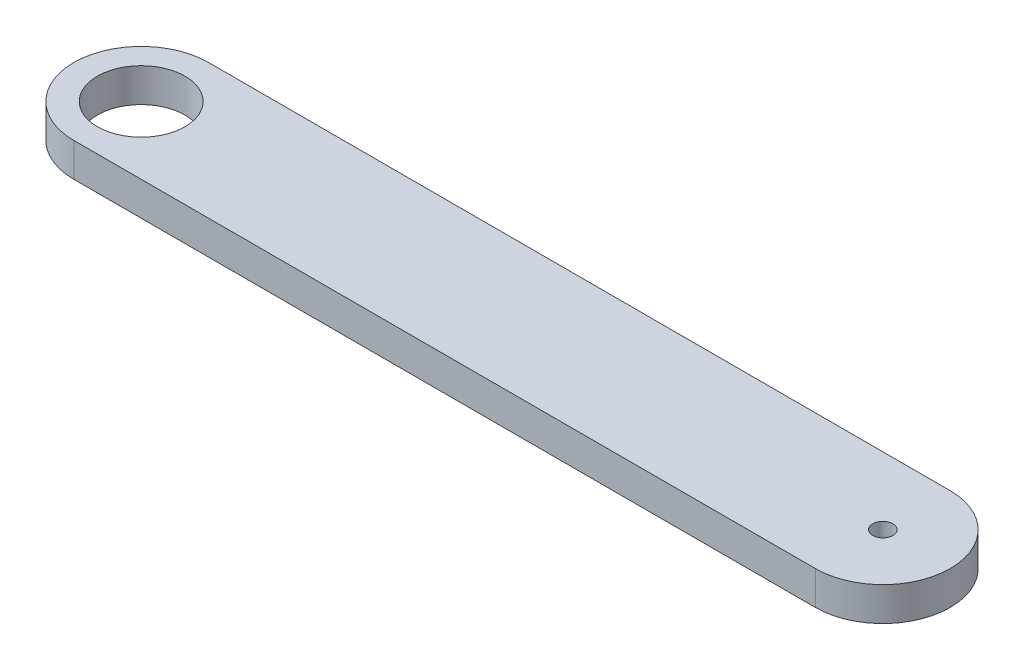
ISO-10303-21;
HEADER;
FILE_DESCRIPTION(('STEP AP214'),'2;1');
FILE_NAME('part.step','',(''),(''),'','','');
FILE_SCHEMA(('AUTOMOTIVE_DESIGN { 1 0 10303 214 1 1 1 1 }'));
ENDSEC;
DATA;
#1=APPLICATION_CONTEXT('core data for automotive mechanical design processes');
#2=APPLICATION_PROTOCOL_DEFINITION('international standard','automotive_design',2000,#1);
#3=PRODUCT_CONTEXT('',#1,'mechanical');
#4=PRODUCT('Part','Part','',(#3));
#5=PRODUCT_RELATED_PRODUCT_CATEGORY('part','',(#4));
#6=PRODUCT_DEFINITION_FORMATION('','',#4);
#7=PRODUCT_DEFINITION_CONTEXT('part definition',#1,'design');
#8=PRODUCT_DEFINITION('design','',#6,#7);
#9=PRODUCT_DEFINITION_SHAPE('','',#8);
#10=(LENGTH_UNIT() NAMED_UNIT(*) SI_UNIT(.MILLI.,.METRE.));
#11=(NAMED_UNIT(*) PLANE_ANGLE_UNIT() SI_UNIT($,.RADIAN.));
#12=(NAMED_UNIT(*) SI_UNIT($,.STERADIAN.) SOLID_ANGLE_UNIT());
#13=UNCERTAINTY_MEASURE_WITH_UNIT(LENGTH_MEASURE(1.E-05),#10,'distance_accuracy_value','');
#14=(GEOMETRIC_REPRESENTATION_CONTEXT(3) GLOBAL_UNCERTAINTY_ASSIGNED_CONTEXT((#13)) GLOBAL_UNIT_ASSIGNED_CONTEXT((#10,
#11,#12)) REPRESENTATION_CONTEXT('',''));
#15=CARTESIAN_POINT('',(0.,0.,0.));
#16=DIRECTION('',(0.,0.,1.));
#17=DIRECTION('',(1.,0.,0.));
#18=AXIS2_PLACEMENT_3D('',#15,#16,#17);
#19=CARTESIAN_POINT('',(220.,10.,0.));
#20=DIRECTION('',(0.,1.,0.));
#21=DIRECTION('',(0.,0.,1.));
#22=AXIS2_PLACEMENT_3D('',#19,#20,#21);
#23=PLANE('',#22);
#24=CARTESIAN_POINT('',(0.,10.,0.));
#25=DIRECTION('',(0.,1.,0.));
#26=DIRECTION('',(0.,0.,1.));
#27=AXIS2_PLACEMENT_3D('',#24,#25,#26);
#28=CIRCLE('',#27,13.);
#29=CARTESIAN_POINT('',(0.,10.,13.));
#30=VERTEX_POINT('',#29);
#31=EDGE_CURVE('E100',#30,#30,#28,.T.);
#32=ORIENTED_EDGE('',*,*,#31,.F.);
#33=EDGE_LOOP('',(#32));
#34=FACE_BOUND('',#33,.T.);
#35=CARTESIAN_POINT('',(220.,10.,0.));
#36=DIRECTION('',(0.,1.,0.));
#37=DIRECTION('',(0.,0.,1.));
#38=AXIS2_PLACEMENT_3D('',#35,#36,#37);
#39=CIRCLE('',#38,20.);
#40=CARTESIAN_POINT('',(220.,10.,20.));
#41=VERTEX_POINT('',#40);
#42=CARTESIAN_POINT('',(220.,10.,-20.));
#43=VERTEX_POINT('',#42);
#44=EDGE_CURVE('E85',#41,#43,#39,.T.);
#45=ORIENTED_EDGE('',*,*,#44,.T.);
#46=DIRECTION('',(-1.,0.,0.));
#47=VECTOR('',#46,1.);
#48=CARTESIAN_POINT('',(220.,10.,-20.));
#49=LINE('',#48,#47);
#50=CARTESIAN_POINT('',(0.,10.,-20.));
#51=VERTEX_POINT('',#50);
#52=EDGE_CURVE('E80',#43,#51,#49,.T.);
#53=ORIENTED_EDGE('',*,*,#52,.T.);
#54=CARTESIAN_POINT('',(0.,10.,0.));
#55=DIRECTION('',(0.,1.,0.));
#56=DIRECTION('',(0.,0.,1.));
#57=AXIS2_PLACEMENT_3D('',#54,#55,#56);
#58=CIRCLE('',#57,20.);
#59=CARTESIAN_POINT('',(0.,10.,20.));
#60=VERTEX_POINT('',#59);
#61=EDGE_CURVE('E83',#51,#60,#58,.T.);
#62=ORIENTED_EDGE('',*,*,#61,.T.);
#63=DIRECTION('',(1.,0.,0.));
#64=VECTOR('',#63,1.);
#65=CARTESIAN_POINT('',(0.,10.,20.));
#66=LINE('',#65,#64);
#67=EDGE_CURVE('E50',#60,#41,#66,.T.);
#68=ORIENTED_EDGE('',*,*,#67,.T.);
#69=EDGE_LOOP('',(#45,#53,#62,#68));
#70=FACE_BOUND('',#69,.T.);
#71=CARTESIAN_POINT('',(220.,10.,0.));
#72=DIRECTION('',(0.,1.,0.));
#73=DIRECTION('',(0.,0.,1.));
#74=AXIS2_PLACEMENT_3D('',#71,#72,#73);
#75=CIRCLE('',#74,2.99999999999999);
#76=CARTESIAN_POINT('',(220.,10.,2.99999999999999));
#77=VERTEX_POINT('',#76);
#78=EDGE_CURVE('E115',#77,#77,#75,.T.);
#79=ORIENTED_EDGE('',*,*,#78,.F.);
#80=EDGE_LOOP('',(#79));
#81=FACE_BOUND('',#80,.T.);
#82=ADVANCED_FACE('F33',(#34,#70,#81),#23,.T.);
#83=CARTESIAN_POINT('',(220.,0.,0.));
#84=DIRECTION('',(0.,1.,0.));
#85=DIRECTION('',(0.,0.,1.));
#86=AXIS2_PLACEMENT_3D('',#83,#84,#85);
#87=PLANE('',#86);
#88=CARTESIAN_POINT('',(220.,0.,0.));
#89=DIRECTION('',(0.,1.,0.));
#90=DIRECTION('',(0.,0.,1.));
#91=AXIS2_PLACEMENT_3D('',#88,#89,#90);
#92=CIRCLE('',#91,20.);
#93=CARTESIAN_POINT('',(220.,0.,20.));
#94=VERTEX_POINT('',#93);
#95=CARTESIAN_POINT('',(220.,0.,-20.));
#96=VERTEX_POINT('',#95);
#97=EDGE_CURVE('E97',#94,#96,#92,.T.);
#98=ORIENTED_EDGE('',*,*,#97,.F.);
#99=DIRECTION('',(1.,0.,0.));
#100=VECTOR('',#99,1.);
#101=CARTESIAN_POINT('',(0.,0.,20.));
#102=LINE('',#101,#100);
#103=CARTESIAN_POINT('',(0.,0.,20.));
#104=VERTEX_POINT('',#103);
#105=EDGE_CURVE('E73',#104,#94,#102,.T.);
#106=ORIENTED_EDGE('',*,*,#105,.F.);
#107=CARTESIAN_POINT('',(0.,0.,0.));
#108=DIRECTION('',(0.,1.,0.));
#109=DIRECTION('',(0.,0.,1.));
#110=AXIS2_PLACEMENT_3D('',#107,#108,#109);
#111=CIRCLE('',#110,20.);
#112=CARTESIAN_POINT('',(0.,0.,-20.));
#113=VERTEX_POINT('',#112);
#114=EDGE_CURVE('E67',#113,#104,#111,.T.);
#115=ORIENTED_EDGE('',*,*,#114,.F.);
#116=DIRECTION('',(-1.,0.,0.));
#117=VECTOR('',#116,1.);
#118=CARTESIAN_POINT('',(220.,0.,-20.));
#119=LINE('',#118,#117);
#120=EDGE_CURVE('E89',#96,#113,#119,.T.);
#121=ORIENTED_EDGE('',*,*,#120,.F.);
#122=EDGE_LOOP('',(#98,#106,#115,#121));
#123=FACE_BOUND('',#122,.T.);
#124=CARTESIAN_POINT('',(0.,0.,0.));
#125=DIRECTION('',(0.,1.,0.));
#126=DIRECTION('',(0.,0.,1.));
#127=AXIS2_PLACEMENT_3D('',#124,#125,#126);
#128=CIRCLE('',#127,13.);
#129=CARTESIAN_POINT('',(0.,0.,13.));
#130=VERTEX_POINT('',#129);
#131=EDGE_CURVE('E112',#130,#130,#128,.T.);
#132=ORIENTED_EDGE('',*,*,#131,.T.);
#133=EDGE_LOOP('',(#132));
#134=FACE_BOUND('',#133,.T.);
#135=CARTESIAN_POINT('',(220.,0.,0.));
#136=DIRECTION('',(0.,1.,0.));
#137=DIRECTION('',(0.,0.,1.));
#138=AXIS2_PLACEMENT_3D('',#135,#136,#137);
#139=CIRCLE('',#138,2.99999999999999);
#140=CARTESIAN_POINT('',(220.,0.,2.99999999999999));
#141=VERTEX_POINT('',#140);
#142=EDGE_CURVE('E118',#141,#141,#139,.T.);
#143=ORIENTED_EDGE('',*,*,#142,.T.);
#144=EDGE_LOOP('',(#143));
#145=FACE_BOUND('',#144,.T.);
#146=ADVANCED_FACE('F108',(#123,#134,#145),#87,.F.);
#147=CARTESIAN_POINT('',(220.,10.,0.));
#148=DIRECTION('',(0.,-1.,0.));
#149=DIRECTION('',(0.,0.,-1.));
#150=AXIS2_PLACEMENT_3D('',#147,#148,#149);
#151=CYLINDRICAL_SURFACE('',#150,20.);
#152=ORIENTED_EDGE('',*,*,#97,.T.);
#153=DIRECTION('',(0.,-1.,0.));
#154=VECTOR('',#153,1.);
#155=CARTESIAN_POINT('',(220.,10.,-20.));
#156=LINE('',#155,#154);
#157=EDGE_CURVE('E11',#43,#96,#156,.T.);
#158=ORIENTED_EDGE('',*,*,#157,.F.);
#159=ORIENTED_EDGE('',*,*,#44,.F.);
#160=DIRECTION('',(0.,-1.,0.));
#161=VECTOR('',#160,1.);
#162=CARTESIAN_POINT('',(220.,10.,20.));
#163=LINE('',#162,#161);
#164=EDGE_CURVE('E93',#41,#94,#163,.T.);
#165=ORIENTED_EDGE('',*,*,#164,.T.);
#166=EDGE_LOOP('',(#152,#158,#159,#165));
#167=FACE_BOUND('',#166,.T.);
#168=ADVANCED_FACE('F35',(#167),#151,.T.);
#169=CARTESIAN_POINT('',(220.,10.,-20.));
#170=DIRECTION('',(0.,0.,1.));
#171=DIRECTION('',(1.,0.,0.));
#172=AXIS2_PLACEMENT_3D('',#169,#170,#171);
#173=PLANE('',#172);
#174=ORIENTED_EDGE('',*,*,#120,.T.);
#175=DIRECTION('',(0.,-1.,0.));
#176=VECTOR('',#175,1.);
#177=CARTESIAN_POINT('',(0.,10.,-20.));
#178=LINE('',#177,#176);
#179=EDGE_CURVE('E42',#51,#113,#178,.T.);
#180=ORIENTED_EDGE('',*,*,#179,.F.);
#181=ORIENTED_EDGE('',*,*,#52,.F.);
#182=ORIENTED_EDGE('',*,*,#157,.T.);
#183=EDGE_LOOP('',(#174,#180,#181,#182));
#184=FACE_BOUND('',#183,.T.);
#185=ADVANCED_FACE('F88',(#184),#173,.F.);
#186=CARTESIAN_POINT('',(0.,10.,0.));
#187=DIRECTION('',(0.,-1.,0.));
#188=DIRECTION('',(0.,0.,-1.));
#189=AXIS2_PLACEMENT_3D('',#186,#187,#188);
#190=CYLINDRICAL_SURFACE('',#189,20.);
#191=ORIENTED_EDGE('',*,*,#114,.T.);
#192=DIRECTION('',(0.,-1.,0.));
#193=VECTOR('',#192,1.);
#194=CARTESIAN_POINT('',(0.,10.,20.));
#195=LINE('',#194,#193);
#196=EDGE_CURVE('E90',#60,#104,#195,.T.);
#197=ORIENTED_EDGE('',*,*,#196,.F.);
#198=ORIENTED_EDGE('',*,*,#61,.F.);
#199=ORIENTED_EDGE('',*,*,#179,.T.);
#200=EDGE_LOOP('',(#191,#197,#198,#199));
#201=FACE_BOUND('',#200,.T.);
#202=ADVANCED_FACE('F91',(#201),#190,.T.);
#203=CARTESIAN_POINT('',(0.,10.,20.));
#204=DIRECTION('',(0.,0.,-1.));
#205=DIRECTION('',(-1.,0.,0.));
#206=AXIS2_PLACEMENT_3D('',#203,#204,#205);
#207=PLANE('',#206);
#208=ORIENTED_EDGE('',*,*,#105,.T.);
#209=ORIENTED_EDGE('',*,*,#164,.F.);
#210=ORIENTED_EDGE('',*,*,#67,.F.);
#211=ORIENTED_EDGE('',*,*,#196,.T.);
#212=EDGE_LOOP('',(#208,#209,#210,#211));
#213=FACE_BOUND('',#212,.T.);
#214=ADVANCED_FACE('F105',(#213),#207,.F.);
#215=CARTESIAN_POINT('',(0.,10.,0.));
#216=DIRECTION('',(0.,-1.,0.));
#217=DIRECTION('',(0.,0.,-1.));
#218=AXIS2_PLACEMENT_3D('',#215,#216,#217);
#219=CYLINDRICAL_SURFACE('',#218,13.);
#220=ORIENTED_EDGE('',*,*,#31,.T.);
#221=EDGE_LOOP('',(#220));
#222=FACE_BOUND('',#221,.T.);
#223=ORIENTED_EDGE('',*,*,#131,.F.);
#224=EDGE_LOOP('',(#223));
#225=FACE_BOUND('',#224,.T.);
#226=ADVANCED_FACE('F135',(#222,#225),#219,.F.);
#227=CARTESIAN_POINT('',(220.,10.,0.));
#228=DIRECTION('',(0.,-1.,0.));
#229=DIRECTION('',(0.,0.,-1.));
#230=AXIS2_PLACEMENT_3D('',#227,#228,#229);
#231=CYLINDRICAL_SURFACE('',#230,2.99999999999999);
#232=ORIENTED_EDGE('',*,*,#78,.T.);
#233=EDGE_LOOP('',(#232));
#234=FACE_BOUND('',#233,.T.);
#235=ORIENTED_EDGE('',*,*,#142,.F.);
#236=EDGE_LOOP('',(#235));
#237=FACE_BOUND('',#236,.T.);
#238=ADVANCED_FACE('F124',(#234,#237),#231,.F.);
#239=CLOSED_SHELL('',(#82,#146,#168,#185,#202,#214,#226,#238));
#240=MANIFOLD_SOLID_BREP('B2',#239);
#241=ADVANCED_BREP_SHAPE_REPRESENTATION('',(#18,#240),#14);
#242=SHAPE_DEFINITION_REPRESENTATION(#9,#241);
ENDSEC;
END-ISO-10303-21;
